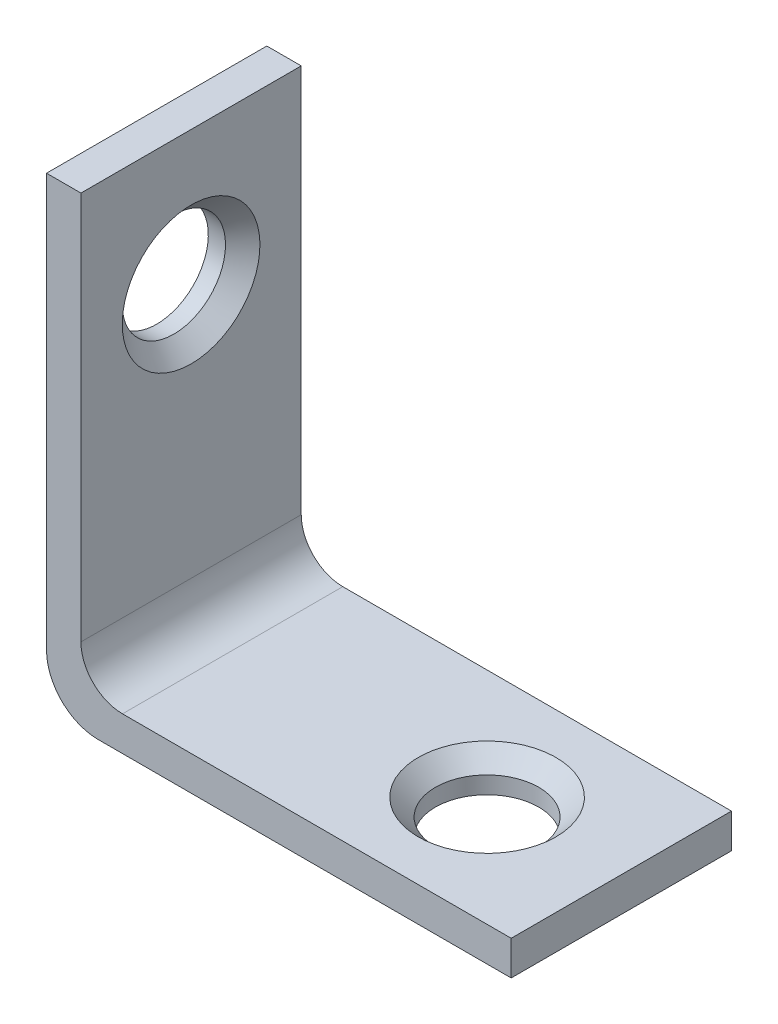
ISO-10303-21;
HEADER;
FILE_DESCRIPTION(('STEP AP214'),'2;1');
FILE_NAME('part.step','',(''),(''),'','','');
FILE_SCHEMA(('AUTOMOTIVE_DESIGN { 1 0 10303 214 1 1 1 1 }'));
ENDSEC;
DATA;
#1=APPLICATION_CONTEXT('core data for automotive mechanical design processes');
#2=APPLICATION_PROTOCOL_DEFINITION('international standard','automotive_design',2000,#1);
#3=PRODUCT_CONTEXT('',#1,'mechanical');
#4=PRODUCT('Part','Part','',(#3));
#5=PRODUCT_RELATED_PRODUCT_CATEGORY('part','',(#4));
#6=PRODUCT_DEFINITION_FORMATION('','',#4);
#7=PRODUCT_DEFINITION_CONTEXT('part definition',#1,'design');
#8=PRODUCT_DEFINITION('design','',#6,#7);
#9=PRODUCT_DEFINITION_SHAPE('','',#8);
#10=(LENGTH_UNIT() NAMED_UNIT(*) SI_UNIT(.MILLI.,.METRE.));
#11=(NAMED_UNIT(*) PLANE_ANGLE_UNIT() SI_UNIT($,.RADIAN.));
#12=(NAMED_UNIT(*) SI_UNIT($,.STERADIAN.) SOLID_ANGLE_UNIT());
#13=UNCERTAINTY_MEASURE_WITH_UNIT(LENGTH_MEASURE(1.E-05),#10,'distance_accuracy_value','');
#14=(GEOMETRIC_REPRESENTATION_CONTEXT(3) GLOBAL_UNCERTAINTY_ASSIGNED_CONTEXT((#13)) GLOBAL_UNIT_ASSIGNED_CONTEXT((#10,
#11,#12)) REPRESENTATION_CONTEXT('',''));
#15=CARTESIAN_POINT('',(0.,0.,0.));
#16=DIRECTION('',(0.,0.,1.));
#17=DIRECTION('',(1.,0.,0.));
#18=AXIS2_PLACEMENT_3D('',#15,#16,#17);
#19=CARTESIAN_POINT('',(3.,3.,6.4));
#20=DIRECTION('',(0.,0.,-1.));
#21=DIRECTION('',(-1.,0.,0.));
#22=AXIS2_PLACEMENT_3D('',#19,#20,#21);
#23=CYLINDRICAL_SURFACE('',#22,3.);
#24=CARTESIAN_POINT('',(3.,3.,-6.4));
#25=DIRECTION('',(0.,0.,1.));
#26=DIRECTION('',(-1.,0.,0.));
#27=AXIS2_PLACEMENT_3D('',#24,#25,#26);
#28=CIRCLE('',#27,3.);
#29=CARTESIAN_POINT('',(0.,3.,-6.4));
#30=VERTEX_POINT('',#29);
#31=CARTESIAN_POINT('',(3.,0.,-6.4));
#32=VERTEX_POINT('',#31);
#33=EDGE_CURVE('E135',#30,#32,#28,.T.);
#34=ORIENTED_EDGE('',*,*,#33,.T.);
#35=DIRECTION('',(0.,0.,-1.));
#36=VECTOR('',#35,1.);
#37=CARTESIAN_POINT('',(3.,0.,6.4));
#38=LINE('',#37,#36);
#39=CARTESIAN_POINT('',(3.,0.,6.4));
#40=VERTEX_POINT('',#39);
#41=EDGE_CURVE('E163',#40,#32,#38,.T.);
#42=ORIENTED_EDGE('',*,*,#41,.F.);
#43=CARTESIAN_POINT('',(3.,3.,6.4));
#44=DIRECTION('',(0.,0.,1.));
#45=DIRECTION('',(-1.,0.,0.));
#46=AXIS2_PLACEMENT_3D('',#43,#44,#45);
#47=CIRCLE('',#46,3.);
#48=CARTESIAN_POINT('',(0.,3.,6.4));
#49=VERTEX_POINT('',#48);
#50=EDGE_CURVE('E150',#49,#40,#47,.T.);
#51=ORIENTED_EDGE('',*,*,#50,.F.);
#52=DIRECTION('',(0.,0.,-1.));
#53=VECTOR('',#52,1.);
#54=CARTESIAN_POINT('',(0.,3.,6.4));
#55=LINE('',#54,#53);
#56=EDGE_CURVE('E131',#49,#30,#55,.T.);
#57=ORIENTED_EDGE('',*,*,#56,.T.);
#58=EDGE_LOOP('',(#34,#42,#51,#57));
#59=FACE_BOUND('',#58,.T.);
#60=ADVANCED_FACE('F37',(#59),#23,.T.);
#61=CARTESIAN_POINT('',(3.,0.,6.4));
#62=DIRECTION('',(0.,1.,0.));
#63=DIRECTION('',(0.,0.,1.));
#64=AXIS2_PLACEMENT_3D('',#61,#62,#63);
#65=PLANE('',#64);
#66=CARTESIAN_POINT('',(19.2,0.,0.));
#67=DIRECTION('',(0.,1.,0.));
#68=DIRECTION('',(-1.,0.,0.));
#69=AXIS2_PLACEMENT_3D('',#66,#67,#68);
#70=CIRCLE('',#69,3.);
#71=CARTESIAN_POINT('',(16.2,0.,0.));
#72=VERTEX_POINT('',#71);
#73=EDGE_CURVE('E139',#72,#72,#70,.T.);
#74=ORIENTED_EDGE('',*,*,#73,.T.);
#75=EDGE_LOOP('',(#74));
#76=FACE_BOUND('',#75,.T.);
#77=DIRECTION('',(1.,0.,0.));
#78=VECTOR('',#77,1.);
#79=CARTESIAN_POINT('',(3.,0.,-6.4));
#80=LINE('',#79,#78);
#81=CARTESIAN_POINT('',(27.,0.,-6.4));
#82=VERTEX_POINT('',#81);
#83=EDGE_CURVE('E138',#32,#82,#80,.T.);
#84=ORIENTED_EDGE('',*,*,#83,.T.);
#85=DIRECTION('',(0.,0.,-1.));
#86=VECTOR('',#85,1.);
#87=CARTESIAN_POINT('',(27.,0.,6.4));
#88=LINE('',#87,#86);
#89=CARTESIAN_POINT('',(27.,0.,6.4));
#90=VERTEX_POINT('',#89);
#91=EDGE_CURVE('E160',#90,#82,#88,.T.);
#92=ORIENTED_EDGE('',*,*,#91,.F.);
#93=DIRECTION('',(1.,0.,0.));
#94=VECTOR('',#93,1.);
#95=CARTESIAN_POINT('',(3.,0.,6.4));
#96=LINE('',#95,#94);
#97=EDGE_CURVE('E98',#40,#90,#96,.T.);
#98=ORIENTED_EDGE('',*,*,#97,.F.);
#99=ORIENTED_EDGE('',*,*,#41,.T.);
#100=EDGE_LOOP('',(#84,#92,#98,#99));
#101=FACE_BOUND('',#100,.T.);
#102=ADVANCED_FACE('F186',(#76,#101),#65,.F.);
#103=CARTESIAN_POINT('',(27.,0.,6.4));
#104=DIRECTION('',(-1.,0.,0.));
#105=DIRECTION('',(0.,0.,1.));
#106=AXIS2_PLACEMENT_3D('',#103,#104,#105);
#107=PLANE('',#106);
#108=DIRECTION('',(0.,1.,0.));
#109=VECTOR('',#108,1.);
#110=CARTESIAN_POINT('',(27.,0.,-6.4));
#111=LINE('',#110,#109);
#112=CARTESIAN_POINT('',(27.,2.,-6.4));
#113=VERTEX_POINT('',#112);
#114=EDGE_CURVE('E141',#82,#113,#111,.T.);
#115=ORIENTED_EDGE('',*,*,#114,.T.);
#116=DIRECTION('',(0.,0.,-1.));
#117=VECTOR('',#116,1.);
#118=CARTESIAN_POINT('',(27.,2.,6.4));
#119=LINE('',#118,#117);
#120=CARTESIAN_POINT('',(27.,2.,6.4));
#121=VERTEX_POINT('',#120);
#122=EDGE_CURVE('E157',#121,#113,#119,.T.);
#123=ORIENTED_EDGE('',*,*,#122,.F.);
#124=DIRECTION('',(0.,1.,0.));
#125=VECTOR('',#124,1.);
#126=CARTESIAN_POINT('',(27.,0.,6.4));
#127=LINE('',#126,#125);
#128=EDGE_CURVE('E240',#90,#121,#127,.T.);
#129=ORIENTED_EDGE('',*,*,#128,.F.);
#130=ORIENTED_EDGE('',*,*,#91,.T.);
#131=EDGE_LOOP('',(#115,#123,#129,#130));
#132=FACE_BOUND('',#131,.T.);
#133=ADVANCED_FACE('F192',(#132),#107,.F.);
#134=CARTESIAN_POINT('',(27.,2.,6.4));
#135=DIRECTION('',(0.,-1.,0.));
#136=DIRECTION('',(1.,0.,0.));
#137=AXIS2_PLACEMENT_3D('',#134,#135,#136);
#138=PLANE('',#137);
#139=CARTESIAN_POINT('',(19.2,2.,0.));
#140=DIRECTION('',(0.,-1.,0.));
#141=DIRECTION('',(1.,0.,0.));
#142=AXIS2_PLACEMENT_3D('',#139,#140,#141);
#143=CIRCLE('',#142,4.);
#144=CARTESIAN_POINT('',(23.2,2.,0.));
#145=VERTEX_POINT('',#144);
#146=EDGE_CURVE('E11',#145,#145,#143,.T.);
#147=ORIENTED_EDGE('',*,*,#146,.T.);
#148=EDGE_LOOP('',(#147));
#149=FACE_BOUND('',#148,.T.);
#150=DIRECTION('',(-1.,0.,0.));
#151=VECTOR('',#150,1.);
#152=CARTESIAN_POINT('',(27.,2.,-6.4));
#153=LINE('',#152,#151);
#154=CARTESIAN_POINT('',(4.4142135623731,2.,-6.4));
#155=VERTEX_POINT('',#154);
#156=EDGE_CURVE('E143',#113,#155,#153,.T.);
#157=ORIENTED_EDGE('',*,*,#156,.T.);
#158=DIRECTION('',(0.,0.,-1.));
#159=VECTOR('',#158,1.);
#160=CARTESIAN_POINT('',(4.4142135623731,2.,6.4));
#161=LINE('',#160,#159);
#162=CARTESIAN_POINT('',(4.4142135623731,2.,6.4));
#163=VERTEX_POINT('',#162);
#164=EDGE_CURVE('E154',#163,#155,#161,.T.);
#165=ORIENTED_EDGE('',*,*,#164,.F.);
#166=DIRECTION('',(-1.,0.,0.));
#167=VECTOR('',#166,1.);
#168=CARTESIAN_POINT('',(27.,2.,6.4));
#169=LINE('',#168,#167);
#170=EDGE_CURVE('E242',#121,#163,#169,.T.);
#171=ORIENTED_EDGE('',*,*,#170,.F.);
#172=ORIENTED_EDGE('',*,*,#122,.T.);
#173=EDGE_LOOP('',(#157,#165,#171,#172));
#174=FACE_BOUND('',#173,.T.);
#175=ADVANCED_FACE('F198',(#149,#174),#138,.F.);
#176=CARTESIAN_POINT('',(4.4142135623731,4.41421356237309,6.4));
#177=DIRECTION('',(0.,0.,-1.));
#178=DIRECTION('',(-1.,0.,0.));
#179=AXIS2_PLACEMENT_3D('',#176,#177,#178);
#180=CYLINDRICAL_SURFACE('',#179,2.41421356237309);
#181=CARTESIAN_POINT('',(4.4142135623731,4.41421356237309,-6.4));
#182=DIRECTION('',(0.,0.,-1.));
#183=DIRECTION('',(1.,0.,0.));
#184=AXIS2_PLACEMENT_3D('',#181,#182,#183);
#185=CIRCLE('',#184,2.41421356237309);
#186=CARTESIAN_POINT('',(2.,4.41421356237309,-6.4));
#187=VERTEX_POINT('',#186);
#188=EDGE_CURVE('E145',#155,#187,#185,.T.);
#189=ORIENTED_EDGE('',*,*,#188,.T.);
#190=DIRECTION('',(0.,0.,-1.));
#191=VECTOR('',#190,1.);
#192=CARTESIAN_POINT('',(2.,4.41421356237309,6.4));
#193=LINE('',#192,#191);
#194=CARTESIAN_POINT('',(2.,4.41421356237309,6.4));
#195=VERTEX_POINT('',#194);
#196=EDGE_CURVE('E126',#195,#187,#193,.T.);
#197=ORIENTED_EDGE('',*,*,#196,.F.);
#198=CARTESIAN_POINT('',(4.4142135623731,4.41421356237309,6.4));
#199=DIRECTION('',(0.,0.,-1.));
#200=DIRECTION('',(1.,0.,0.));
#201=AXIS2_PLACEMENT_3D('',#198,#199,#200);
#202=CIRCLE('',#201,2.41421356237309);
#203=EDGE_CURVE('E117',#163,#195,#202,.T.);
#204=ORIENTED_EDGE('',*,*,#203,.F.);
#205=ORIENTED_EDGE('',*,*,#164,.T.);
#206=EDGE_LOOP('',(#189,#197,#204,#205));
#207=FACE_BOUND('',#206,.T.);
#208=ADVANCED_FACE('F202',(#207),#180,.F.);
#209=CARTESIAN_POINT('',(2.,27.,6.4));
#210=DIRECTION('',(-1.,0.,0.));
#211=DIRECTION('',(0.,-1.,0.));
#212=AXIS2_PLACEMENT_3D('',#209,#210,#211);
#213=PLANE('',#212);
#214=CARTESIAN_POINT('',(2.,19.2,0.));
#215=DIRECTION('',(-1.,0.,0.));
#216=DIRECTION('',(0.,-1.,0.));
#217=AXIS2_PLACEMENT_3D('',#214,#215,#216);
#218=CIRCLE('',#217,4.00000000000001);
#219=CARTESIAN_POINT('',(2.,15.2,0.));
#220=VERTEX_POINT('',#219);
#221=EDGE_CURVE('E168',#220,#220,#218,.T.);
#222=ORIENTED_EDGE('',*,*,#221,.T.);
#223=EDGE_LOOP('',(#222));
#224=FACE_BOUND('',#223,.T.);
#225=DIRECTION('',(0.,1.,0.));
#226=VECTOR('',#225,1.);
#227=CARTESIAN_POINT('',(2.,27.,-6.4));
#228=LINE('',#227,#226);
#229=CARTESIAN_POINT('',(2.,27.,-6.4));
#230=VERTEX_POINT('',#229);
#231=EDGE_CURVE('E125',#187,#230,#228,.T.);
#232=ORIENTED_EDGE('',*,*,#231,.T.);
#233=DIRECTION('',(0.,0.,-1.));
#234=VECTOR('',#233,1.);
#235=CARTESIAN_POINT('',(2.,27.,6.4));
#236=LINE('',#235,#234);
#237=CARTESIAN_POINT('',(2.,27.,6.4));
#238=VERTEX_POINT('',#237);
#239=EDGE_CURVE('E122',#238,#230,#236,.T.);
#240=ORIENTED_EDGE('',*,*,#239,.F.);
#241=DIRECTION('',(0.,1.,0.));
#242=VECTOR('',#241,1.);
#243=CARTESIAN_POINT('',(2.,27.,6.4));
#244=LINE('',#243,#242);
#245=EDGE_CURVE('E111',#195,#238,#244,.T.);
#246=ORIENTED_EDGE('',*,*,#245,.F.);
#247=ORIENTED_EDGE('',*,*,#196,.T.);
#248=EDGE_LOOP('',(#232,#240,#246,#247));
#249=FACE_BOUND('',#248,.T.);
#250=ADVANCED_FACE('F123',(#224,#249),#213,.F.);
#251=CARTESIAN_POINT('',(0.,27.,6.4));
#252=DIRECTION('',(0.,-1.,0.));
#253=DIRECTION('',(0.,0.,-1.));
#254=AXIS2_PLACEMENT_3D('',#251,#252,#253);
#255=PLANE('',#254);
#256=DIRECTION('',(-1.,0.,0.));
#257=VECTOR('',#256,1.);
#258=CARTESIAN_POINT('',(0.,27.,-6.4));
#259=LINE('',#258,#257);
#260=CARTESIAN_POINT('',(0.,27.,-6.4));
#261=VERTEX_POINT('',#260);
#262=EDGE_CURVE('E83',#230,#261,#259,.T.);
#263=ORIENTED_EDGE('',*,*,#262,.T.);
#264=DIRECTION('',(0.,0.,-1.));
#265=VECTOR('',#264,1.);
#266=CARTESIAN_POINT('',(0.,27.,6.4));
#267=LINE('',#266,#265);
#268=CARTESIAN_POINT('',(0.,27.,6.4));
#269=VERTEX_POINT('',#268);
#270=EDGE_CURVE('E127',#269,#261,#267,.T.);
#271=ORIENTED_EDGE('',*,*,#270,.F.);
#272=DIRECTION('',(-1.,0.,0.));
#273=VECTOR('',#272,1.);
#274=CARTESIAN_POINT('',(0.,27.,6.4));
#275=LINE('',#274,#273);
#276=EDGE_CURVE('E115',#238,#269,#275,.T.);
#277=ORIENTED_EDGE('',*,*,#276,.F.);
#278=ORIENTED_EDGE('',*,*,#239,.T.);
#279=EDGE_LOOP('',(#263,#271,#277,#278));
#280=FACE_BOUND('',#279,.T.);
#281=ADVANCED_FACE('F129',(#280),#255,.F.);
#282=CARTESIAN_POINT('',(0.,3.,6.4));
#283=DIRECTION('',(1.,0.,0.));
#284=DIRECTION('',(0.,0.,-1.));
#285=AXIS2_PLACEMENT_3D('',#282,#283,#284);
#286=PLANE('',#285);
#287=CARTESIAN_POINT('',(0.,19.2,0.));
#288=DIRECTION('',(1.,0.,0.));
#289=DIRECTION('',(0.,1.,0.));
#290=AXIS2_PLACEMENT_3D('',#287,#288,#289);
#291=CIRCLE('',#290,3.);
#292=CARTESIAN_POINT('',(0.,22.2,0.));
#293=VERTEX_POINT('',#292);
#294=EDGE_CURVE('E233',#293,#293,#291,.T.);
#295=ORIENTED_EDGE('',*,*,#294,.T.);
#296=EDGE_LOOP('',(#295));
#297=FACE_BOUND('',#296,.T.);
#298=DIRECTION('',(0.,-1.,0.));
#299=VECTOR('',#298,1.);
#300=CARTESIAN_POINT('',(0.,3.,-6.4));
#301=LINE('',#300,#299);
#302=EDGE_CURVE('E89',#261,#30,#301,.T.);
#303=ORIENTED_EDGE('',*,*,#302,.T.);
#304=ORIENTED_EDGE('',*,*,#56,.F.);
#305=DIRECTION('',(0.,-1.,0.));
#306=VECTOR('',#305,1.);
#307=CARTESIAN_POINT('',(0.,3.,6.4));
#308=LINE('',#307,#306);
#309=EDGE_CURVE('E54',#269,#49,#308,.T.);
#310=ORIENTED_EDGE('',*,*,#309,.F.);
#311=ORIENTED_EDGE('',*,*,#270,.T.);
#312=EDGE_LOOP('',(#303,#304,#310,#311));
#313=FACE_BOUND('',#312,.T.);
#314=ADVANCED_FACE('F212',(#297,#313),#286,.F.);
#315=CARTESIAN_POINT('',(3.,3.,6.4));
#316=DIRECTION('',(0.,0.,-1.));
#317=DIRECTION('',(-1.,0.,0.));
#318=AXIS2_PLACEMENT_3D('',#315,#316,#317);
#319=PLANE('',#318);
#320=ORIENTED_EDGE('',*,*,#50,.T.);
#321=ORIENTED_EDGE('',*,*,#97,.T.);
#322=ORIENTED_EDGE('',*,*,#128,.T.);
#323=ORIENTED_EDGE('',*,*,#170,.T.);
#324=ORIENTED_EDGE('',*,*,#203,.T.);
#325=ORIENTED_EDGE('',*,*,#245,.T.);
#326=ORIENTED_EDGE('',*,*,#276,.T.);
#327=ORIENTED_EDGE('',*,*,#309,.T.);
#328=EDGE_LOOP('',(#320,#321,#322,#323,#324,#325,#326,#327));
#329=FACE_BOUND('',#328,.T.);
#330=ADVANCED_FACE('F113',(#329),#319,.F.);
#331=CARTESIAN_POINT('',(3.,3.,-6.4));
#332=DIRECTION('',(0.,0.,-1.));
#333=DIRECTION('',(-1.,0.,0.));
#334=AXIS2_PLACEMENT_3D('',#331,#332,#333);
#335=PLANE('',#334);
#336=ORIENTED_EDGE('',*,*,#33,.F.);
#337=ORIENTED_EDGE('',*,*,#302,.F.);
#338=ORIENTED_EDGE('',*,*,#262,.F.);
#339=ORIENTED_EDGE('',*,*,#231,.F.);
#340=ORIENTED_EDGE('',*,*,#188,.F.);
#341=ORIENTED_EDGE('',*,*,#156,.F.);
#342=ORIENTED_EDGE('',*,*,#114,.F.);
#343=ORIENTED_EDGE('',*,*,#83,.F.);
#344=EDGE_LOOP('',(#336,#337,#338,#339,#340,#341,#342,#343));
#345=FACE_BOUND('',#344,.T.);
#346=ADVANCED_FACE('F216',(#345),#335,.T.);
#347=CARTESIAN_POINT('',(19.2,0.,0.));
#348=DIRECTION('',(0.,1.,0.));
#349=DIRECTION('',(-1.,0.,0.));
#350=AXIS2_PLACEMENT_3D('',#347,#348,#349);
#351=CYLINDRICAL_SURFACE('',#350,3.);
#352=CARTESIAN_POINT('',(19.2,1.00000000000001,0.));
#353=DIRECTION('',(0.,-1.,0.));
#354=DIRECTION('',(0.,0.,-1.));
#355=AXIS2_PLACEMENT_3D('',#352,#353,#354);
#356=CIRCLE('',#355,3.);
#357=CARTESIAN_POINT('',(19.2,1.00000000000001,-3.));
#358=VERTEX_POINT('',#357);
#359=EDGE_CURVE('E46',#358,#358,#356,.F.);
#360=ORIENTED_EDGE('',*,*,#359,.T.);
#361=EDGE_LOOP('',(#360));
#362=FACE_BOUND('',#361,.T.);
#363=ORIENTED_EDGE('',*,*,#73,.F.);
#364=EDGE_LOOP('',(#363));
#365=FACE_BOUND('',#364,.T.);
#366=ADVANCED_FACE('F173',(#362,#365),#351,.F.);
#367=CARTESIAN_POINT('',(0.,19.2,0.));
#368=DIRECTION('',(1.,0.,0.));
#369=DIRECTION('',(0.,1.,0.));
#370=AXIS2_PLACEMENT_3D('',#367,#368,#369);
#371=CYLINDRICAL_SURFACE('',#370,3.);
#372=CARTESIAN_POINT('',(0.999999999999993,19.2,0.));
#373=DIRECTION('',(-1.,0.,0.));
#374=DIRECTION('',(0.,0.,1.));
#375=AXIS2_PLACEMENT_3D('',#372,#373,#374);
#376=CIRCLE('',#375,3.);
#377=CARTESIAN_POINT('',(0.999999999999993,19.2,3.));
#378=VERTEX_POINT('',#377);
#379=EDGE_CURVE('E165',#378,#378,#376,.F.);
#380=ORIENTED_EDGE('',*,*,#379,.T.);
#381=EDGE_LOOP('',(#380));
#382=FACE_BOUND('',#381,.T.);
#383=ORIENTED_EDGE('',*,*,#294,.F.);
#384=EDGE_LOOP('',(#383));
#385=FACE_BOUND('',#384,.T.);
#386=ADVANCED_FACE('F182',(#382,#385),#371,.F.);
#387=CARTESIAN_POINT('',(0.999999999999993,19.2,0.));
#388=DIRECTION('',(1.,0.,0.));
#389=DIRECTION('',(0.,0.,-1.));
#390=AXIS2_PLACEMENT_3D('',#387,#388,#389);
#391=CONICAL_SURFACE('',#390,3.,0.78539816339745);
#392=ORIENTED_EDGE('',*,*,#221,.F.);
#393=EDGE_LOOP('',(#392));
#394=FACE_BOUND('',#393,.T.);
#395=ORIENTED_EDGE('',*,*,#379,.F.);
#396=EDGE_LOOP('',(#395));
#397=FACE_BOUND('',#396,.T.);
#398=ADVANCED_FACE('F177',(#394,#397),#391,.F.);
#399=CARTESIAN_POINT('',(19.2,1.00000000000001,0.));
#400=DIRECTION('',(0.,1.,0.));
#401=DIRECTION('',(0.,0.,1.));
#402=AXIS2_PLACEMENT_3D('',#399,#400,#401);
#403=CONICAL_SURFACE('',#402,3.,0.785398163397453);
#404=ORIENTED_EDGE('',*,*,#146,.F.);
#405=EDGE_LOOP('',(#404));
#406=FACE_BOUND('',#405,.T.);
#407=ORIENTED_EDGE('',*,*,#359,.F.);
#408=EDGE_LOOP('',(#407));
#409=FACE_BOUND('',#408,.T.);
#410=ADVANCED_FACE('F39',(#406,#409),#403,.F.);
#411=CLOSED_SHELL('',(#60,#102,#133,#175,#208,#250,#281,#314,#330,#346,#366,#386,#398,#410));
#412=MANIFOLD_SOLID_BREP('B2',#411);
#413=ADVANCED_BREP_SHAPE_REPRESENTATION('',(#18,#412),#14);
#414=SHAPE_DEFINITION_REPRESENTATION(#9,#413);
ENDSEC;
END-ISO-10303-21;
